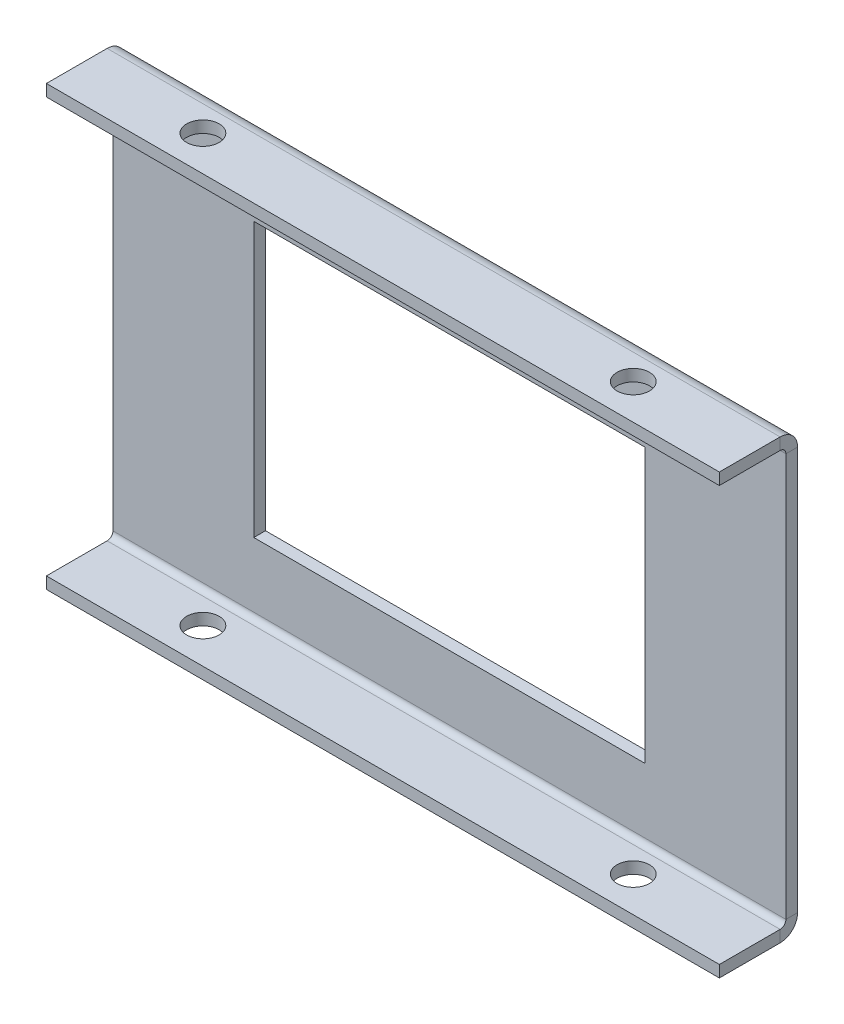
ISO-10303-21;
HEADER;
FILE_DESCRIPTION(('STEP AP214'),'2;1');
FILE_NAME('part.step','',(''),(''),'','','');
FILE_SCHEMA(('AUTOMOTIVE_DESIGN { 1 0 10303 214 1 1 1 1 }'));
ENDSEC;
DATA;
#1=APPLICATION_CONTEXT('core data for automotive mechanical design processes');
#2=APPLICATION_PROTOCOL_DEFINITION('international standard','automotive_design',2000,#1);
#3=PRODUCT_CONTEXT('',#1,'mechanical');
#4=PRODUCT('Part','Part','',(#3));
#5=PRODUCT_RELATED_PRODUCT_CATEGORY('part','',(#4));
#6=PRODUCT_DEFINITION_FORMATION('','',#4);
#7=PRODUCT_DEFINITION_CONTEXT('part definition',#1,'design');
#8=PRODUCT_DEFINITION('design','',#6,#7);
#9=PRODUCT_DEFINITION_SHAPE('','',#8);
#10=(LENGTH_UNIT() NAMED_UNIT(*) SI_UNIT(.MILLI.,.METRE.));
#11=(NAMED_UNIT(*) PLANE_ANGLE_UNIT() SI_UNIT($,.RADIAN.));
#12=(NAMED_UNIT(*) SI_UNIT($,.STERADIAN.) SOLID_ANGLE_UNIT());
#13=UNCERTAINTY_MEASURE_WITH_UNIT(LENGTH_MEASURE(1.E-05),#10,'distance_accuracy_value','');
#14=(GEOMETRIC_REPRESENTATION_CONTEXT(3) GLOBAL_UNCERTAINTY_ASSIGNED_CONTEXT((#13)) GLOBAL_UNIT_ASSIGNED_CONTEXT((#10,
#11,#12)) REPRESENTATION_CONTEXT('',''));
#15=CARTESIAN_POINT('',(0.,0.,0.));
#16=DIRECTION('',(0.,0.,1.));
#17=DIRECTION('',(1.,0.,0.));
#18=AXIS2_PLACEMENT_3D('',#15,#16,#17);
#19=CARTESIAN_POINT('',(0.,0.,0.));
#20=DIRECTION('',(-1.,0.,0.));
#21=DIRECTION('',(0.,0.,1.));
#22=AXIS2_PLACEMENT_3D('',#19,#20,#21);
#23=PLANE('',#22);
#24=DIRECTION('',(0.,1.,0.));
#25=VECTOR('',#24,1.);
#26=CARTESIAN_POINT('',(0.,0.,1.5));
#27=LINE('',#26,#25);
#28=CARTESIAN_POINT('',(0.,52.2634,1.5));
#29=VERTEX_POINT('',#28);
#30=CARTESIAN_POINT('',(0.,0.736599999999992,1.5));
#31=VERTEX_POINT('',#30);
#32=EDGE_CURVE('E284',#29,#31,#27,.F.);
#33=ORIENTED_EDGE('',*,*,#32,.F.);
#34=DIRECTION('',(0.,0.,-1.));
#35=VECTOR('',#34,1.);
#36=CARTESIAN_POINT('',(0.,52.2634,1.5));
#37=LINE('',#36,#35);
#38=CARTESIAN_POINT('',(0.,52.2634,0.));
#39=VERTEX_POINT('',#38);
#40=EDGE_CURVE('E262',#29,#39,#37,.T.);
#41=ORIENTED_EDGE('',*,*,#40,.T.);
#42=DIRECTION('',(0.,-1.,0.));
#43=VECTOR('',#42,1.);
#44=CARTESIAN_POINT('',(0.,0.,0.));
#45=LINE('',#44,#43);
#46=CARTESIAN_POINT('',(0.,0.736600000000008,0.));
#47=VERTEX_POINT('',#46);
#48=EDGE_CURVE('E278',#39,#47,#45,.T.);
#49=ORIENTED_EDGE('',*,*,#48,.T.);
#50=DIRECTION('',(0.,0.,-1.));
#51=VECTOR('',#50,1.);
#52=CARTESIAN_POINT('',(0.,0.736599999999997,1.5));
#53=LINE('',#52,#51);
#54=EDGE_CURVE('E292',#31,#47,#53,.T.);
#55=ORIENTED_EDGE('',*,*,#54,.F.);
#56=EDGE_LOOP('',(#33,#41,#49,#55));
#57=FACE_BOUND('',#56,.T.);
#58=ADVANCED_FACE('F79',(#57),#23,.T.);
#59=CARTESIAN_POINT('',(0.,0.,0.));
#60=DIRECTION('',(0.,0.,-1.));
#61=DIRECTION('',(-1.,0.,0.));
#62=AXIS2_PLACEMENT_3D('',#59,#60,#61);
#63=PLANE('',#62);
#64=DIRECTION('',(0.,-1.,0.));
#65=VECTOR('',#64,1.);
#66=CARTESIAN_POINT('',(68.,9.,0.));
#67=LINE('',#66,#65);
#68=CARTESIAN_POINT('',(68.,44.,0.));
#69=VERTEX_POINT('',#68);
#70=CARTESIAN_POINT('',(68.,9.,0.));
#71=VERTEX_POINT('',#70);
#72=EDGE_CURVE('E96',#69,#71,#67,.T.);
#73=ORIENTED_EDGE('',*,*,#72,.F.);
#74=DIRECTION('',(1.,0.,0.));
#75=VECTOR('',#74,1.);
#76=CARTESIAN_POINT('',(68.,44.,0.));
#77=LINE('',#76,#75);
#78=CARTESIAN_POINT('',(18.,44.,0.));
#79=VERTEX_POINT('',#78);
#80=EDGE_CURVE('E213',#79,#69,#77,.T.);
#81=ORIENTED_EDGE('',*,*,#80,.F.);
#82=DIRECTION('',(0.,1.,0.));
#83=VECTOR('',#82,1.);
#84=CARTESIAN_POINT('',(18.,9.,0.));
#85=LINE('',#84,#83);
#86=CARTESIAN_POINT('',(18.,9.,0.));
#87=VERTEX_POINT('',#86);
#88=EDGE_CURVE('E197',#87,#79,#85,.T.);
#89=ORIENTED_EDGE('',*,*,#88,.F.);
#90=DIRECTION('',(-1.,0.,0.));
#91=VECTOR('',#90,1.);
#92=CARTESIAN_POINT('',(68.,9.,0.));
#93=LINE('',#92,#91);
#94=EDGE_CURVE('E206',#71,#87,#93,.T.);
#95=ORIENTED_EDGE('',*,*,#94,.F.);
#96=EDGE_LOOP('',(#73,#81,#89,#95));
#97=FACE_BOUND('',#96,.T.);
#98=ORIENTED_EDGE('',*,*,#48,.F.);
#99=DIRECTION('',(-1.,0.,0.));
#100=VECTOR('',#99,1.);
#101=CARTESIAN_POINT('',(0.,52.2634,0.));
#102=LINE('',#101,#100);
#103=CARTESIAN_POINT('',(86.,52.2634,0.));
#104=VERTEX_POINT('',#103);
#105=EDGE_CURVE('E255',#39,#104,#102,.F.);
#106=ORIENTED_EDGE('',*,*,#105,.T.);
#107=DIRECTION('',(0.,1.,0.));
#108=VECTOR('',#107,1.);
#109=CARTESIAN_POINT('',(86.,54.5,0.));
#110=LINE('',#109,#108);
#111=CARTESIAN_POINT('',(85.9999999999999,0.736599999999992,0.));
#112=VERTEX_POINT('',#111);
#113=EDGE_CURVE('E281',#112,#104,#110,.T.);
#114=ORIENTED_EDGE('',*,*,#113,.F.);
#115=DIRECTION('',(-1.,0.,0.));
#116=VECTOR('',#115,1.);
#117=CARTESIAN_POINT('',(0.,0.736600000000008,0.));
#118=LINE('',#117,#116);
#119=EDGE_CURVE('E289',#112,#47,#118,.T.);
#120=ORIENTED_EDGE('',*,*,#119,.T.);
#121=EDGE_LOOP('',(#98,#106,#114,#120));
#122=FACE_BOUND('',#121,.T.);
#123=ADVANCED_FACE('F210',(#97,#122),#63,.T.);
#124=CARTESIAN_POINT('',(0.,0.,1.5));
#125=DIRECTION('',(0.,0.,-1.));
#126=DIRECTION('',(-1.,0.,0.));
#127=AXIS2_PLACEMENT_3D('',#124,#125,#126);
#128=PLANE('',#127);
#129=DIRECTION('',(1.,0.,0.));
#130=VECTOR('',#129,1.);
#131=CARTESIAN_POINT('',(0.,44.,1.5));
#132=LINE('',#131,#130);
#133=CARTESIAN_POINT('',(18.,44.,1.5));
#134=VERTEX_POINT('',#133);
#135=CARTESIAN_POINT('',(68.,44.,1.5));
#136=VERTEX_POINT('',#135);
#137=EDGE_CURVE('E88',#134,#136,#132,.T.);
#138=ORIENTED_EDGE('',*,*,#137,.T.);
#139=DIRECTION('',(0.,-1.,0.));
#140=VECTOR('',#139,1.);
#141=CARTESIAN_POINT('',(68.,0.,1.5));
#142=LINE('',#141,#140);
#143=CARTESIAN_POINT('',(68.,9.,1.5));
#144=VERTEX_POINT('',#143);
#145=EDGE_CURVE('E13',#136,#144,#142,.T.);
#146=ORIENTED_EDGE('',*,*,#145,.T.);
#147=DIRECTION('',(-1.,0.,0.));
#148=VECTOR('',#147,1.);
#149=CARTESIAN_POINT('',(0.,9.,1.5));
#150=LINE('',#149,#148);
#151=CARTESIAN_POINT('',(18.,9.,1.5));
#152=VERTEX_POINT('',#151);
#153=EDGE_CURVE('E344',#144,#152,#150,.T.);
#154=ORIENTED_EDGE('',*,*,#153,.T.);
#155=DIRECTION('',(0.,1.,0.));
#156=VECTOR('',#155,1.);
#157=CARTESIAN_POINT('',(18.,0.,1.5));
#158=LINE('',#157,#156);
#159=EDGE_CURVE('E200',#152,#134,#158,.T.);
#160=ORIENTED_EDGE('',*,*,#159,.T.);
#161=EDGE_LOOP('',(#138,#146,#154,#160));
#162=FACE_BOUND('',#161,.T.);
#163=DIRECTION('',(-1.,0.,0.));
#164=VECTOR('',#163,1.);
#165=CARTESIAN_POINT('',(0.,52.2634,1.5));
#166=LINE('',#165,#164);
#167=CARTESIAN_POINT('',(86.,52.2634,1.5));
#168=VERTEX_POINT('',#167);
#169=EDGE_CURVE('E268',#29,#168,#166,.F.);
#170=ORIENTED_EDGE('',*,*,#169,.F.);
#171=ORIENTED_EDGE('',*,*,#32,.T.);
#172=DIRECTION('',(1.,0.,0.));
#173=VECTOR('',#172,1.);
#174=CARTESIAN_POINT('',(86.,0.736599999999997,1.5));
#175=LINE('',#174,#173);
#176=CARTESIAN_POINT('',(86.,0.736599999999992,1.5));
#177=VERTEX_POINT('',#176);
#178=EDGE_CURVE('E295',#177,#31,#175,.F.);
#179=ORIENTED_EDGE('',*,*,#178,.F.);
#180=DIRECTION('',(0.,-1.,0.));
#181=VECTOR('',#180,1.);
#182=CARTESIAN_POINT('',(86.,0.,1.5));
#183=LINE('',#182,#181);
#184=EDGE_CURVE('E286',#177,#168,#183,.F.);
#185=ORIENTED_EDGE('',*,*,#184,.T.);
#186=EDGE_LOOP('',(#170,#171,#179,#185));
#187=FACE_BOUND('',#186,.T.);
#188=ADVANCED_FACE('F399',(#162,#187),#128,.F.);
#189=CARTESIAN_POINT('',(0.,-1.5,10.));
#190=DIRECTION('',(0.,1.,0.));
#191=DIRECTION('',(0.,0.,1.));
#192=AXIS2_PLACEMENT_3D('',#189,#190,#191);
#193=PLANE('',#192);
#194=CARTESIAN_POINT('',(70.5,-1.50000000000002,5.50000000000018));
#195=DIRECTION('',(0.,1.,0.));
#196=DIRECTION('',(0.,0.,-1.));
#197=AXIS2_PLACEMENT_3D('',#194,#195,#196);
#198=CIRCLE('',#197,2.07290710134149);
#199=CARTESIAN_POINT('',(70.5,-1.50000000000003,3.42709289865869));
#200=VERTEX_POINT('',#199);
#201=EDGE_CURVE('E370',#200,#200,#198,.T.);
#202=ORIENTED_EDGE('',*,*,#201,.T.);
#203=EDGE_LOOP('',(#202));
#204=FACE_BOUND('',#203,.T.);
#205=CARTESIAN_POINT('',(15.5,-1.50000000000002,5.50000000000018));
#206=DIRECTION('',(0.,1.,0.));
#207=DIRECTION('',(0.,0.,1.));
#208=AXIS2_PLACEMENT_3D('',#205,#206,#207);
#209=CIRCLE('',#208,2.07290710134151);
#210=CARTESIAN_POINT('',(15.5,-1.50000000000002,7.57290710134169));
#211=VERTEX_POINT('',#210);
#212=EDGE_CURVE('E351',#211,#211,#209,.T.);
#213=ORIENTED_EDGE('',*,*,#212,.T.);
#214=EDGE_LOOP('',(#213));
#215=FACE_BOUND('',#214,.T.);
#216=DIRECTION('',(-1.,0.,0.));
#217=VECTOR('',#216,1.);
#218=CARTESIAN_POINT('',(0.,-1.50000000000001,2.2366));
#219=LINE('',#218,#217);
#220=CARTESIAN_POINT('',(0.,-1.50000000000001,2.2366));
#221=VERTEX_POINT('',#220);
#222=CARTESIAN_POINT('',(86.,-1.5,2.2366));
#223=VERTEX_POINT('',#222);
#224=EDGE_CURVE('E300',#221,#223,#219,.F.);
#225=ORIENTED_EDGE('',*,*,#224,.T.);
#226=DIRECTION('',(0.,0.,-1.));
#227=VECTOR('',#226,1.);
#228=CARTESIAN_POINT('',(86.,-1.5,10.));
#229=LINE('',#228,#227);
#230=CARTESIAN_POINT('',(86.,-1.5,10.));
#231=VERTEX_POINT('',#230);
#232=EDGE_CURVE('E341',#231,#223,#229,.T.);
#233=ORIENTED_EDGE('',*,*,#232,.F.);
#234=DIRECTION('',(1.,0.,0.));
#235=VECTOR('',#234,1.);
#236=CARTESIAN_POINT('',(0.,-1.5,10.));
#237=LINE('',#236,#235);
#238=CARTESIAN_POINT('',(0.,-1.5,10.));
#239=VERTEX_POINT('',#238);
#240=EDGE_CURVE('E320',#239,#231,#237,.T.);
#241=ORIENTED_EDGE('',*,*,#240,.F.);
#242=DIRECTION('',(0.,0.,-1.));
#243=VECTOR('',#242,1.);
#244=CARTESIAN_POINT('',(0.,-1.5,10.));
#245=LINE('',#244,#243);
#246=EDGE_CURVE('E333',#239,#221,#245,.T.);
#247=ORIENTED_EDGE('',*,*,#246,.T.);
#248=EDGE_LOOP('',(#225,#233,#241,#247));
#249=FACE_BOUND('',#248,.T.);
#250=ADVANCED_FACE('F81',(#204,#215,#249),#193,.F.);
#251=CARTESIAN_POINT('',(0.,0.,10.));
#252=DIRECTION('',(0.,1.,0.));
#253=DIRECTION('',(0.,0.,1.));
#254=AXIS2_PLACEMENT_3D('',#251,#252,#253);
#255=PLANE('',#254);
#256=CARTESIAN_POINT('',(70.5,0.,5.50000000000018));
#257=DIRECTION('',(0.,1.,0.));
#258=DIRECTION('',(0.,0.,1.));
#259=AXIS2_PLACEMENT_3D('',#256,#257,#258);
#260=CIRCLE('',#259,2.07290710134149);
#261=CARTESIAN_POINT('',(70.5,0.,7.57290710134167));
#262=VERTEX_POINT('',#261);
#263=EDGE_CURVE('E362',#262,#262,#260,.T.);
#264=ORIENTED_EDGE('',*,*,#263,.F.);
#265=EDGE_LOOP('',(#264));
#266=FACE_BOUND('',#265,.T.);
#267=CARTESIAN_POINT('',(15.5,0.,5.50000000000018));
#268=DIRECTION('',(0.,1.,0.));
#269=DIRECTION('',(0.,0.,1.));
#270=AXIS2_PLACEMENT_3D('',#267,#268,#269);
#271=CIRCLE('',#270,2.07290710134151);
#272=CARTESIAN_POINT('',(15.5,0.,7.57290710134168));
#273=VERTEX_POINT('',#272);
#274=EDGE_CURVE('E350',#273,#273,#271,.T.);
#275=ORIENTED_EDGE('',*,*,#274,.F.);
#276=EDGE_LOOP('',(#275));
#277=FACE_BOUND('',#276,.T.);
#278=DIRECTION('',(0.,0.,-1.));
#279=VECTOR('',#278,1.);
#280=CARTESIAN_POINT('',(86.,0.,10.));
#281=LINE('',#280,#279);
#282=CARTESIAN_POINT('',(86.,0.,10.));
#283=VERTEX_POINT('',#282);
#284=CARTESIAN_POINT('',(86.,0.,2.2366));
#285=VERTEX_POINT('',#284);
#286=EDGE_CURVE('E338',#283,#285,#281,.T.);
#287=ORIENTED_EDGE('',*,*,#286,.T.);
#288=DIRECTION('',(-1.,0.,0.));
#289=VECTOR('',#288,1.);
#290=CARTESIAN_POINT('',(0.,0.,2.2366));
#291=LINE('',#290,#289);
#292=CARTESIAN_POINT('',(0.,0.,2.2366));
#293=VERTEX_POINT('',#292);
#294=EDGE_CURVE('E312',#293,#285,#291,.F.);
#295=ORIENTED_EDGE('',*,*,#294,.F.);
#296=DIRECTION('',(0.,0.,-1.));
#297=VECTOR('',#296,1.);
#298=CARTESIAN_POINT('',(0.,0.,10.));
#299=LINE('',#298,#297);
#300=CARTESIAN_POINT('',(0.,0.,10.));
#301=VERTEX_POINT('',#300);
#302=EDGE_CURVE('E335',#301,#293,#299,.T.);
#303=ORIENTED_EDGE('',*,*,#302,.F.);
#304=DIRECTION('',(1.,0.,0.));
#305=VECTOR('',#304,1.);
#306=CARTESIAN_POINT('',(0.,0.,10.));
#307=LINE('',#306,#305);
#308=EDGE_CURVE('E327',#301,#283,#307,.T.);
#309=ORIENTED_EDGE('',*,*,#308,.T.);
#310=EDGE_LOOP('',(#287,#295,#303,#309));
#311=FACE_BOUND('',#310,.T.);
#312=ADVANCED_FACE('F433',(#266,#277,#311),#255,.T.);
#313=CARTESIAN_POINT('',(0.,-1.5,10.));
#314=DIRECTION('',(-1.,0.,0.));
#315=DIRECTION('',(0.,0.,1.));
#316=AXIS2_PLACEMENT_3D('',#313,#314,#315);
#317=PLANE('',#316);
#318=ORIENTED_EDGE('',*,*,#302,.T.);
#319=DIRECTION('',(0.,-1.,0.));
#320=VECTOR('',#319,1.);
#321=CARTESIAN_POINT('',(0.,0.,2.2366));
#322=LINE('',#321,#320);
#323=EDGE_CURVE('E306',#293,#221,#322,.T.);
#324=ORIENTED_EDGE('',*,*,#323,.T.);
#325=ORIENTED_EDGE('',*,*,#246,.F.);
#326=DIRECTION('',(0.,1.,0.));
#327=VECTOR('',#326,1.);
#328=CARTESIAN_POINT('',(0.,-1.5,10.));
#329=LINE('',#328,#327);
#330=EDGE_CURVE('E330',#239,#301,#329,.T.);
#331=ORIENTED_EDGE('',*,*,#330,.T.);
#332=EDGE_LOOP('',(#318,#324,#325,#331));
#333=FACE_BOUND('',#332,.T.);
#334=ADVANCED_FACE('F430',(#333),#317,.T.);
#335=CARTESIAN_POINT('',(86.,0.,10.));
#336=DIRECTION('',(1.,0.,0.));
#337=DIRECTION('',(0.,0.,-1.));
#338=AXIS2_PLACEMENT_3D('',#335,#336,#337);
#339=PLANE('',#338);
#340=DIRECTION('',(0.,-1.,0.));
#341=VECTOR('',#340,1.);
#342=CARTESIAN_POINT('',(86.,0.,2.2366));
#343=LINE('',#342,#341);
#344=EDGE_CURVE('E317',#285,#223,#343,.T.);
#345=ORIENTED_EDGE('',*,*,#344,.F.);
#346=ORIENTED_EDGE('',*,*,#286,.F.);
#347=DIRECTION('',(0.,-1.,0.));
#348=VECTOR('',#347,1.);
#349=CARTESIAN_POINT('',(86.,0.,10.));
#350=LINE('',#349,#348);
#351=EDGE_CURVE('E324',#283,#231,#350,.T.);
#352=ORIENTED_EDGE('',*,*,#351,.T.);
#353=ORIENTED_EDGE('',*,*,#232,.T.);
#354=EDGE_LOOP('',(#345,#346,#352,#353));
#355=FACE_BOUND('',#354,.T.);
#356=ADVANCED_FACE('F428',(#355),#339,.T.);
#357=CARTESIAN_POINT('',(0.,0.,10.));
#358=DIRECTION('',(0.,0.,-1.));
#359=DIRECTION('',(-1.,0.,0.));
#360=AXIS2_PLACEMENT_3D('',#357,#358,#359);
#361=PLANE('',#360);
#362=ORIENTED_EDGE('',*,*,#240,.T.);
#363=ORIENTED_EDGE('',*,*,#351,.F.);
#364=ORIENTED_EDGE('',*,*,#308,.F.);
#365=ORIENTED_EDGE('',*,*,#330,.F.);
#366=EDGE_LOOP('',(#362,#363,#364,#365));
#367=FACE_BOUND('',#366,.T.);
#368=ADVANCED_FACE('F421',(#367),#361,.F.);
#369=CARTESIAN_POINT('',(86.,0.736599999999992,2.2366));
#370=DIRECTION('',(1.,0.,0.));
#371=DIRECTION('',(0.,0.,-1.));
#372=AXIS2_PLACEMENT_3D('',#369,#370,#371);
#373=PLANE('',#372);
#374=DIRECTION('',(0.,0.,-1.));
#375=VECTOR('',#374,1.);
#376=CARTESIAN_POINT('',(86.,0.736600000000011,-3.75427815625518E-13));
#377=LINE('',#376,#375);
#378=EDGE_CURVE('E275',#177,#112,#377,.T.);
#379=ORIENTED_EDGE('',*,*,#378,.F.);
#380=CARTESIAN_POINT('',(86.,0.736599999999992,2.2366));
#381=DIRECTION('',(-1.,0.,0.));
#382=DIRECTION('',(0.,0.,1.));
#383=AXIS2_PLACEMENT_3D('',#380,#381,#382);
#384=CIRCLE('',#383,0.7366);
#385=EDGE_CURVE('E309',#285,#177,#384,.F.);
#386=ORIENTED_EDGE('',*,*,#385,.F.);
#387=ORIENTED_EDGE('',*,*,#344,.T.);
#388=CARTESIAN_POINT('',(85.9999999999999,0.736599999999992,2.2366));
#389=DIRECTION('',(-1.,0.,0.));
#390=DIRECTION('',(0.,0.,1.));
#391=AXIS2_PLACEMENT_3D('',#388,#389,#390);
#392=CIRCLE('',#391,2.2366);
#393=EDGE_CURVE('E302',#223,#112,#392,.F.);
#394=ORIENTED_EDGE('',*,*,#393,.T.);
#395=EDGE_LOOP('',(#379,#386,#387,#394));
#396=FACE_BOUND('',#395,.T.);
#397=ADVANCED_FACE('F418',(#396),#373,.T.);
#398=CARTESIAN_POINT('',(0.,0.736599999999992,2.2366));
#399=DIRECTION('',(1.,0.,0.));
#400=DIRECTION('',(0.,0.,-1.));
#401=AXIS2_PLACEMENT_3D('',#398,#399,#400);
#402=PLANE('',#401);
#403=CARTESIAN_POINT('',(0.,0.736599999999992,2.2366));
#404=DIRECTION('',(-1.,0.,0.));
#405=DIRECTION('',(0.,0.,1.));
#406=AXIS2_PLACEMENT_3D('',#403,#404,#405);
#407=CIRCLE('',#406,0.7366);
#408=EDGE_CURVE('E280',#31,#293,#407,.T.);
#409=ORIENTED_EDGE('',*,*,#408,.F.);
#410=ORIENTED_EDGE('',*,*,#54,.T.);
#411=CARTESIAN_POINT('',(0.,0.736599999999992,2.2366));
#412=DIRECTION('',(-1.,0.,0.));
#413=DIRECTION('',(0.,0.,1.));
#414=AXIS2_PLACEMENT_3D('',#411,#412,#413);
#415=CIRCLE('',#414,2.2366);
#416=EDGE_CURVE('E303',#47,#221,#415,.T.);
#417=ORIENTED_EDGE('',*,*,#416,.T.);
#418=ORIENTED_EDGE('',*,*,#323,.F.);
#419=EDGE_LOOP('',(#409,#410,#417,#418));
#420=FACE_BOUND('',#419,.T.);
#421=ADVANCED_FACE('F413',(#420),#402,.F.);
#422=CARTESIAN_POINT('',(0.,0.736599999999992,2.2366));
#423=DIRECTION('',(-1.,0.,0.));
#424=DIRECTION('',(0.,0.,-1.));
#425=AXIS2_PLACEMENT_3D('',#422,#423,#424);
#426=CYLINDRICAL_SURFACE('',#425,2.2366);
#427=ORIENTED_EDGE('',*,*,#224,.F.);
#428=ORIENTED_EDGE('',*,*,#416,.F.);
#429=ORIENTED_EDGE('',*,*,#119,.F.);
#430=ORIENTED_EDGE('',*,*,#393,.F.);
#431=EDGE_LOOP('',(#427,#428,#429,#430));
#432=FACE_BOUND('',#431,.T.);
#433=ADVANCED_FACE('F410',(#432),#426,.T.);
#434=CARTESIAN_POINT('',(0.,0.736599999999992,2.2366));
#435=DIRECTION('',(-1.,0.,0.));
#436=DIRECTION('',(0.,0.,-1.));
#437=AXIS2_PLACEMENT_3D('',#434,#435,#436);
#438=CYLINDRICAL_SURFACE('',#437,0.7366);
#439=ORIENTED_EDGE('',*,*,#294,.T.);
#440=ORIENTED_EDGE('',*,*,#385,.T.);
#441=ORIENTED_EDGE('',*,*,#178,.T.);
#442=ORIENTED_EDGE('',*,*,#408,.T.);
#443=EDGE_LOOP('',(#439,#440,#441,#442));
#444=FACE_BOUND('',#443,.T.);
#445=ADVANCED_FACE('F408',(#444),#438,.F.);
#446=CARTESIAN_POINT('',(86.,54.5,0.));
#447=DIRECTION('',(1.,0.,0.));
#448=DIRECTION('',(0.,0.,-1.));
#449=AXIS2_PLACEMENT_3D('',#446,#447,#448);
#450=PLANE('',#449);
#451=DIRECTION('',(0.,0.,-1.));
#452=VECTOR('',#451,1.);
#453=CARTESIAN_POINT('',(86.,52.2634,1.5));
#454=LINE('',#453,#452);
#455=EDGE_CURVE('E272',#168,#104,#454,.T.);
#456=ORIENTED_EDGE('',*,*,#455,.F.);
#457=ORIENTED_EDGE('',*,*,#184,.F.);
#458=ORIENTED_EDGE('',*,*,#378,.T.);
#459=ORIENTED_EDGE('',*,*,#113,.T.);
#460=EDGE_LOOP('',(#456,#457,#458,#459));
#461=FACE_BOUND('',#460,.T.);
#462=ADVANCED_FACE('F404',(#461),#450,.T.);
#463=CARTESIAN_POINT('',(86.,52.2634,2.2366));
#464=DIRECTION('',(1.,0.,0.));
#465=DIRECTION('',(0.,0.,-1.));
#466=AXIS2_PLACEMENT_3D('',#463,#464,#465);
#467=PLANE('',#466);
#468=DIRECTION('',(0.,1.,0.));
#469=VECTOR('',#468,1.);
#470=CARTESIAN_POINT('',(86.,54.5,2.23659999999999));
#471=LINE('',#470,#469);
#472=CARTESIAN_POINT('',(86.,53.,2.2366));
#473=VERTEX_POINT('',#472);
#474=CARTESIAN_POINT('',(86.,54.5,2.23659999999999));
#475=VERTEX_POINT('',#474);
#476=EDGE_CURVE('E220',#473,#475,#471,.T.);
#477=ORIENTED_EDGE('',*,*,#476,.F.);
#478=CARTESIAN_POINT('',(86.,52.2634,2.2366));
#479=DIRECTION('',(-1.,0.,0.));
#480=DIRECTION('',(0.,0.,1.));
#481=AXIS2_PLACEMENT_3D('',#478,#479,#480);
#482=CIRCLE('',#481,0.736599999999997);
#483=EDGE_CURVE('E265',#168,#473,#482,.F.);
#484=ORIENTED_EDGE('',*,*,#483,.F.);
#485=ORIENTED_EDGE('',*,*,#455,.T.);
#486=CARTESIAN_POINT('',(86.,52.2634,2.2366));
#487=DIRECTION('',(-1.,0.,0.));
#488=DIRECTION('',(0.,0.,1.));
#489=AXIS2_PLACEMENT_3D('',#486,#487,#488);
#490=CIRCLE('',#489,2.2366);
#491=EDGE_CURVE('E258',#104,#475,#490,.F.);
#492=ORIENTED_EDGE('',*,*,#491,.T.);
#493=EDGE_LOOP('',(#477,#484,#485,#492));
#494=FACE_BOUND('',#493,.T.);
#495=ADVANCED_FACE('F407',(#494),#467,.T.);
#496=CARTESIAN_POINT('',(0.,52.2634,2.2366));
#497=DIRECTION('',(1.,0.,0.));
#498=DIRECTION('',(0.,0.,-1.));
#499=AXIS2_PLACEMENT_3D('',#496,#497,#498);
#500=PLANE('',#499);
#501=CARTESIAN_POINT('',(0.,52.2634,2.2366));
#502=DIRECTION('',(-1.,0.,0.));
#503=DIRECTION('',(0.,0.,1.));
#504=AXIS2_PLACEMENT_3D('',#501,#502,#503);
#505=CIRCLE('',#504,0.736599999999997);
#506=CARTESIAN_POINT('',(0.,53.,2.2366));
#507=VERTEX_POINT('',#506);
#508=EDGE_CURVE('E225',#507,#29,#505,.T.);
#509=ORIENTED_EDGE('',*,*,#508,.F.);
#510=DIRECTION('',(0.,1.,0.));
#511=VECTOR('',#510,1.);
#512=CARTESIAN_POINT('',(0.,53.,2.2366));
#513=LINE('',#512,#511);
#514=CARTESIAN_POINT('',(0.,54.5,2.23659999999999));
#515=VERTEX_POINT('',#514);
#516=EDGE_CURVE('E248',#507,#515,#513,.T.);
#517=ORIENTED_EDGE('',*,*,#516,.T.);
#518=CARTESIAN_POINT('',(0.,52.2634,2.2366));
#519=DIRECTION('',(-1.,0.,0.));
#520=DIRECTION('',(0.,0.,1.));
#521=AXIS2_PLACEMENT_3D('',#518,#519,#520);
#522=CIRCLE('',#521,2.2366);
#523=EDGE_CURVE('E259',#515,#39,#522,.T.);
#524=ORIENTED_EDGE('',*,*,#523,.T.);
#525=ORIENTED_EDGE('',*,*,#40,.F.);
#526=EDGE_LOOP('',(#509,#517,#524,#525));
#527=FACE_BOUND('',#526,.T.);
#528=ADVANCED_FACE('F457',(#527),#500,.F.);
#529=CARTESIAN_POINT('',(0.,52.2634,2.2366));
#530=DIRECTION('',(-1.,0.,0.));
#531=DIRECTION('',(0.,1.,0.));
#532=AXIS2_PLACEMENT_3D('',#529,#530,#531);
#533=CYLINDRICAL_SURFACE('',#532,2.2366);
#534=ORIENTED_EDGE('',*,*,#105,.F.);
#535=ORIENTED_EDGE('',*,*,#523,.F.);
#536=DIRECTION('',(-1.,0.,0.));
#537=VECTOR('',#536,1.);
#538=CARTESIAN_POINT('',(0.,54.5,2.23659999999999));
#539=LINE('',#538,#537);
#540=EDGE_CURVE('E245',#475,#515,#539,.T.);
#541=ORIENTED_EDGE('',*,*,#540,.F.);
#542=ORIENTED_EDGE('',*,*,#491,.F.);
#543=EDGE_LOOP('',(#534,#535,#541,#542));
#544=FACE_BOUND('',#543,.T.);
#545=ADVANCED_FACE('F454',(#544),#533,.T.);
#546=CARTESIAN_POINT('',(0.,52.2634,2.2366));
#547=DIRECTION('',(-1.,0.,0.));
#548=DIRECTION('',(0.,1.,0.));
#549=AXIS2_PLACEMENT_3D('',#546,#547,#548);
#550=CYLINDRICAL_SURFACE('',#549,0.736599999999997);
#551=ORIENTED_EDGE('',*,*,#169,.T.);
#552=ORIENTED_EDGE('',*,*,#483,.T.);
#553=DIRECTION('',(1.,0.,0.));
#554=VECTOR('',#553,1.);
#555=CARTESIAN_POINT('',(86.,53.,2.2366));
#556=LINE('',#555,#554);
#557=EDGE_CURVE('E251',#473,#507,#556,.F.);
#558=ORIENTED_EDGE('',*,*,#557,.T.);
#559=ORIENTED_EDGE('',*,*,#508,.T.);
#560=EDGE_LOOP('',(#551,#552,#558,#559));
#561=FACE_BOUND('',#560,.T.);
#562=ADVANCED_FACE('F501',(#561),#550,.F.);
#563=CARTESIAN_POINT('',(0.,54.5,1.49999999999999));
#564=DIRECTION('',(-1.,0.,0.));
#565=DIRECTION('',(0.,0.,1.));
#566=AXIS2_PLACEMENT_3D('',#563,#564,#565);
#567=PLANE('',#566);
#568=DIRECTION('',(0.,0.,-1.));
#569=VECTOR('',#568,1.);
#570=CARTESIAN_POINT('',(0.,54.5,1.49999999999999));
#571=LINE('',#570,#569);
#572=CARTESIAN_POINT('',(0.,54.5,10.));
#573=VERTEX_POINT('',#572);
#574=EDGE_CURVE('E229',#573,#515,#571,.T.);
#575=ORIENTED_EDGE('',*,*,#574,.T.);
#576=ORIENTED_EDGE('',*,*,#516,.F.);
#577=DIRECTION('',(0.,0.,1.));
#578=VECTOR('',#577,1.);
#579=CARTESIAN_POINT('',(0.,53.,-1.77962220123738E-13));
#580=LINE('',#579,#578);
#581=CARTESIAN_POINT('',(0.,53.,10.));
#582=VERTEX_POINT('',#581);
#583=EDGE_CURVE('E237',#582,#507,#580,.F.);
#584=ORIENTED_EDGE('',*,*,#583,.F.);
#585=DIRECTION('',(0.,-1.,0.));
#586=VECTOR('',#585,1.);
#587=CARTESIAN_POINT('',(0.,54.5,10.));
#588=LINE('',#587,#586);
#589=EDGE_CURVE('E223',#573,#582,#588,.T.);
#590=ORIENTED_EDGE('',*,*,#589,.F.);
#591=EDGE_LOOP('',(#575,#576,#584,#590));
#592=FACE_BOUND('',#591,.T.);
#593=ADVANCED_FACE('F499',(#592),#567,.T.);
#594=CARTESIAN_POINT('',(86.,54.5,10.));
#595=DIRECTION('',(1.,0.,0.));
#596=DIRECTION('',(0.,0.,-1.));
#597=AXIS2_PLACEMENT_3D('',#594,#595,#596);
#598=PLANE('',#597);
#599=DIRECTION('',(0.,0.,-1.));
#600=VECTOR('',#599,1.);
#601=CARTESIAN_POINT('',(86.,53.,-1.77962220123738E-13));
#602=LINE('',#601,#600);
#603=CARTESIAN_POINT('',(86.,53.,10.));
#604=VERTEX_POINT('',#603);
#605=EDGE_CURVE('E243',#473,#604,#602,.F.);
#606=ORIENTED_EDGE('',*,*,#605,.F.);
#607=ORIENTED_EDGE('',*,*,#476,.T.);
#608=DIRECTION('',(0.,0.,1.));
#609=VECTOR('',#608,1.);
#610=CARTESIAN_POINT('',(86.,54.5,10.));
#611=LINE('',#610,#609);
#612=CARTESIAN_POINT('',(86.,54.5,10.));
#613=VERTEX_POINT('',#612);
#614=EDGE_CURVE('E235',#475,#613,#611,.T.);
#615=ORIENTED_EDGE('',*,*,#614,.T.);
#616=DIRECTION('',(0.,-1.,0.));
#617=VECTOR('',#616,1.);
#618=CARTESIAN_POINT('',(86.,54.5,10.));
#619=LINE('',#618,#617);
#620=EDGE_CURVE('E226',#613,#604,#619,.T.);
#621=ORIENTED_EDGE('',*,*,#620,.T.);
#622=EDGE_LOOP('',(#606,#607,#615,#621));
#623=FACE_BOUND('',#622,.T.);
#624=ADVANCED_FACE('F495',(#623),#598,.T.);
#625=CARTESIAN_POINT('',(0.,54.5,-1.83199442132003E-13));
#626=DIRECTION('',(0.,1.,0.));
#627=DIRECTION('',(0.,0.,1.));
#628=AXIS2_PLACEMENT_3D('',#625,#626,#627);
#629=PLANE('',#628);
#630=CARTESIAN_POINT('',(70.5,54.5,5.5));
#631=DIRECTION('',(0.,1.,0.));
#632=DIRECTION('',(0.,0.,-1.));
#633=AXIS2_PLACEMENT_3D('',#630,#631,#632);
#634=CIRCLE('',#633,2.07290710134149);
#635=CARTESIAN_POINT('',(70.5,54.5,3.42709289865851));
#636=VERTEX_POINT('',#635);
#637=EDGE_CURVE('E367',#636,#636,#634,.T.);
#638=ORIENTED_EDGE('',*,*,#637,.F.);
#639=EDGE_LOOP('',(#638));
#640=FACE_BOUND('',#639,.T.);
#641=CARTESIAN_POINT('',(15.5,54.5,5.5));
#642=DIRECTION('',(0.,1.,0.));
#643=DIRECTION('',(0.,0.,1.));
#644=AXIS2_PLACEMENT_3D('',#641,#642,#643);
#645=CIRCLE('',#644,2.07290710134151);
#646=CARTESIAN_POINT('',(15.5,54.5,7.5729071013415));
#647=VERTEX_POINT('',#646);
#648=EDGE_CURVE('E357',#647,#647,#645,.T.);
#649=ORIENTED_EDGE('',*,*,#648,.F.);
#650=EDGE_LOOP('',(#649));
#651=FACE_BOUND('',#650,.T.);
#652=ORIENTED_EDGE('',*,*,#614,.F.);
#653=ORIENTED_EDGE('',*,*,#540,.T.);
#654=ORIENTED_EDGE('',*,*,#574,.F.);
#655=DIRECTION('',(-1.,0.,0.));
#656=VECTOR('',#655,1.);
#657=CARTESIAN_POINT('',(0.,54.5,10.));
#658=LINE('',#657,#656);
#659=EDGE_CURVE('E232',#613,#573,#658,.T.);
#660=ORIENTED_EDGE('',*,*,#659,.F.);
#661=EDGE_LOOP('',(#652,#653,#654,#660));
#662=FACE_BOUND('',#661,.T.);
#663=ADVANCED_FACE('F492',(#640,#651,#662),#629,.T.);
#664=CARTESIAN_POINT('',(0.,53.,-1.77962220123738E-13));
#665=DIRECTION('',(0.,1.,0.));
#666=DIRECTION('',(0.,0.,1.));
#667=AXIS2_PLACEMENT_3D('',#664,#665,#666);
#668=PLANE('',#667);
#669=CARTESIAN_POINT('',(70.5,53.,5.5));
#670=DIRECTION('',(0.,1.,0.));
#671=DIRECTION('',(0.,0.,1.));
#672=AXIS2_PLACEMENT_3D('',#669,#670,#671);
#673=CIRCLE('',#672,2.07290710134149);
#674=CARTESIAN_POINT('',(70.5,53.,7.5729071013415));
#675=VERTEX_POINT('',#674);
#676=EDGE_CURVE('E83',#675,#675,#673,.T.);
#677=ORIENTED_EDGE('',*,*,#676,.T.);
#678=EDGE_LOOP('',(#677));
#679=FACE_BOUND('',#678,.T.);
#680=CARTESIAN_POINT('',(15.5,53.,5.5));
#681=DIRECTION('',(0.,1.,0.));
#682=DIRECTION('',(0.,0.,1.));
#683=AXIS2_PLACEMENT_3D('',#680,#681,#682);
#684=CIRCLE('',#683,2.07290710134151);
#685=CARTESIAN_POINT('',(15.5,53.,7.57290710134151));
#686=VERTEX_POINT('',#685);
#687=EDGE_CURVE('E348',#686,#686,#684,.T.);
#688=ORIENTED_EDGE('',*,*,#687,.T.);
#689=EDGE_LOOP('',(#688));
#690=FACE_BOUND('',#689,.T.);
#691=ORIENTED_EDGE('',*,*,#557,.F.);
#692=ORIENTED_EDGE('',*,*,#605,.T.);
#693=DIRECTION('',(1.,0.,0.));
#694=VECTOR('',#693,1.);
#695=CARTESIAN_POINT('',(0.,53.,10.));
#696=LINE('',#695,#694);
#697=EDGE_CURVE('E240',#604,#582,#696,.F.);
#698=ORIENTED_EDGE('',*,*,#697,.T.);
#699=ORIENTED_EDGE('',*,*,#583,.T.);
#700=EDGE_LOOP('',(#691,#692,#698,#699));
#701=FACE_BOUND('',#700,.T.);
#702=ADVANCED_FACE('F377',(#679,#690,#701),#668,.F.);
#703=CARTESIAN_POINT('',(0.,54.5,10.));
#704=DIRECTION('',(0.,0.,1.));
#705=DIRECTION('',(0.,-1.,0.));
#706=AXIS2_PLACEMENT_3D('',#703,#704,#705);
#707=PLANE('',#706);
#708=ORIENTED_EDGE('',*,*,#697,.F.);
#709=ORIENTED_EDGE('',*,*,#620,.F.);
#710=ORIENTED_EDGE('',*,*,#659,.T.);
#711=ORIENTED_EDGE('',*,*,#589,.T.);
#712=EDGE_LOOP('',(#708,#709,#710,#711));
#713=FACE_BOUND('',#712,.T.);
#714=ADVANCED_FACE('F480',(#713),#707,.T.);
#715=CARTESIAN_POINT('',(68.,9.,10.));
#716=DIRECTION('',(1.,0.,0.));
#717=DIRECTION('',(0.,0.,-1.));
#718=AXIS2_PLACEMENT_3D('',#715,#716,#717);
#719=PLANE('',#718);
#720=DIRECTION('',(0.,0.,-1.));
#721=VECTOR('',#720,1.);
#722=CARTESIAN_POINT('',(68.,44.,10.));
#723=LINE('',#722,#721);
#724=EDGE_CURVE('E218',#136,#69,#723,.T.);
#725=ORIENTED_EDGE('',*,*,#724,.T.);
#726=ORIENTED_EDGE('',*,*,#72,.T.);
#727=DIRECTION('',(0.,0.,-1.));
#728=VECTOR('',#727,1.);
#729=CARTESIAN_POINT('',(68.,9.,10.));
#730=LINE('',#729,#728);
#731=EDGE_CURVE('E203',#144,#71,#730,.T.);
#732=ORIENTED_EDGE('',*,*,#731,.F.);
#733=ORIENTED_EDGE('',*,*,#145,.F.);
#734=EDGE_LOOP('',(#725,#726,#732,#733));
#735=FACE_BOUND('',#734,.T.);
#736=ADVANCED_FACE('F478',(#735),#719,.F.);
#737=CARTESIAN_POINT('',(68.,44.,10.));
#738=DIRECTION('',(0.,1.,0.));
#739=DIRECTION('',(-1.,0.,0.));
#740=AXIS2_PLACEMENT_3D('',#737,#738,#739);
#741=PLANE('',#740);
#742=DIRECTION('',(0.,0.,-1.));
#743=VECTOR('',#742,1.);
#744=CARTESIAN_POINT('',(18.,44.,10.));
#745=LINE('',#744,#743);
#746=EDGE_CURVE('E202',#134,#79,#745,.T.);
#747=ORIENTED_EDGE('',*,*,#746,.T.);
#748=ORIENTED_EDGE('',*,*,#80,.T.);
#749=ORIENTED_EDGE('',*,*,#724,.F.);
#750=ORIENTED_EDGE('',*,*,#137,.F.);
#751=EDGE_LOOP('',(#747,#748,#749,#750));
#752=FACE_BOUND('',#751,.T.);
#753=ADVANCED_FACE('F477',(#752),#741,.F.);
#754=CARTESIAN_POINT('',(18.,9.,10.));
#755=DIRECTION('',(-1.,0.,0.));
#756=DIRECTION('',(0.,-1.,0.));
#757=AXIS2_PLACEMENT_3D('',#754,#755,#756);
#758=PLANE('',#757);
#759=DIRECTION('',(0.,0.,-1.));
#760=VECTOR('',#759,1.);
#761=CARTESIAN_POINT('',(18.,9.,10.));
#762=LINE('',#761,#760);
#763=EDGE_CURVE('E104',#152,#87,#762,.T.);
#764=ORIENTED_EDGE('',*,*,#763,.T.);
#765=ORIENTED_EDGE('',*,*,#88,.T.);
#766=ORIENTED_EDGE('',*,*,#746,.F.);
#767=ORIENTED_EDGE('',*,*,#159,.F.);
#768=EDGE_LOOP('',(#764,#765,#766,#767));
#769=FACE_BOUND('',#768,.T.);
#770=ADVANCED_FACE('F194',(#769),#758,.F.);
#771=CARTESIAN_POINT('',(68.,9.,10.));
#772=DIRECTION('',(0.,-1.,0.));
#773=DIRECTION('',(0.,0.,-1.));
#774=AXIS2_PLACEMENT_3D('',#771,#772,#773);
#775=PLANE('',#774);
#776=ORIENTED_EDGE('',*,*,#731,.T.);
#777=ORIENTED_EDGE('',*,*,#94,.T.);
#778=ORIENTED_EDGE('',*,*,#763,.F.);
#779=ORIENTED_EDGE('',*,*,#153,.F.);
#780=EDGE_LOOP('',(#776,#777,#778,#779));
#781=FACE_BOUND('',#780,.T.);
#782=ADVANCED_FACE('F207',(#781),#775,.F.);
#783=CARTESIAN_POINT('',(15.5,-1.50000000000002,5.50000000000018));
#784=DIRECTION('',(0.,1.,0.));
#785=DIRECTION('',(0.,0.,1.));
#786=AXIS2_PLACEMENT_3D('',#783,#784,#785);
#787=CYLINDRICAL_SURFACE('',#786,2.07290710134151);
#788=ORIENTED_EDGE('',*,*,#648,.T.);
#789=EDGE_LOOP('',(#788));
#790=FACE_BOUND('',#789,.T.);
#791=ORIENTED_EDGE('',*,*,#687,.F.);
#792=EDGE_LOOP('',(#791));
#793=FACE_BOUND('',#792,.T.);
#794=ADVANCED_FACE('F390',(#790,#793),#787,.F.);
#795=ORIENTED_EDGE('',*,*,#274,.T.);
#796=EDGE_LOOP('',(#795));
#797=FACE_BOUND('',#796,.T.);
#798=ORIENTED_EDGE('',*,*,#212,.F.);
#799=EDGE_LOOP('',(#798));
#800=FACE_BOUND('',#799,.T.);
#801=ADVANCED_FACE('F382',(#797,#800),#787,.F.);
#802=CARTESIAN_POINT('',(70.5,-1.50000000000002,5.50000000000018));
#803=DIRECTION('',(0.,1.,0.));
#804=DIRECTION('',(0.,0.,1.));
#805=AXIS2_PLACEMENT_3D('',#802,#803,#804);
#806=CYLINDRICAL_SURFACE('',#805,2.07290710134149);
#807=ORIENTED_EDGE('',*,*,#637,.T.);
#808=EDGE_LOOP('',(#807));
#809=FACE_BOUND('',#808,.T.);
#810=ORIENTED_EDGE('',*,*,#676,.F.);
#811=EDGE_LOOP('',(#810));
#812=FACE_BOUND('',#811,.T.);
#813=ADVANCED_FACE('F379',(#809,#812),#806,.F.);
#814=ORIENTED_EDGE('',*,*,#263,.T.);
#815=EDGE_LOOP('',(#814));
#816=FACE_BOUND('',#815,.T.);
#817=ORIENTED_EDGE('',*,*,#201,.F.);
#818=EDGE_LOOP('',(#817));
#819=FACE_BOUND('',#818,.T.);
#820=ADVANCED_FACE('F381',(#816,#819),#806,.F.);
#821=CLOSED_SHELL('',(#58,#123,#188,#250,#312,#334,#356,#368,#397,#421,#433,#445,#462,#495,#528,
#545,#562,#593,#624,#663,#702,#714,#736,#753,#770,#782,#794,#801,#813,#820));
#822=MANIFOLD_SOLID_BREP('B2',#821);
#823=ADVANCED_BREP_SHAPE_REPRESENTATION('',(#18,#822),#14);
#824=SHAPE_DEFINITION_REPRESENTATION(#9,#823);
ENDSEC;
END-ISO-10303-21;
